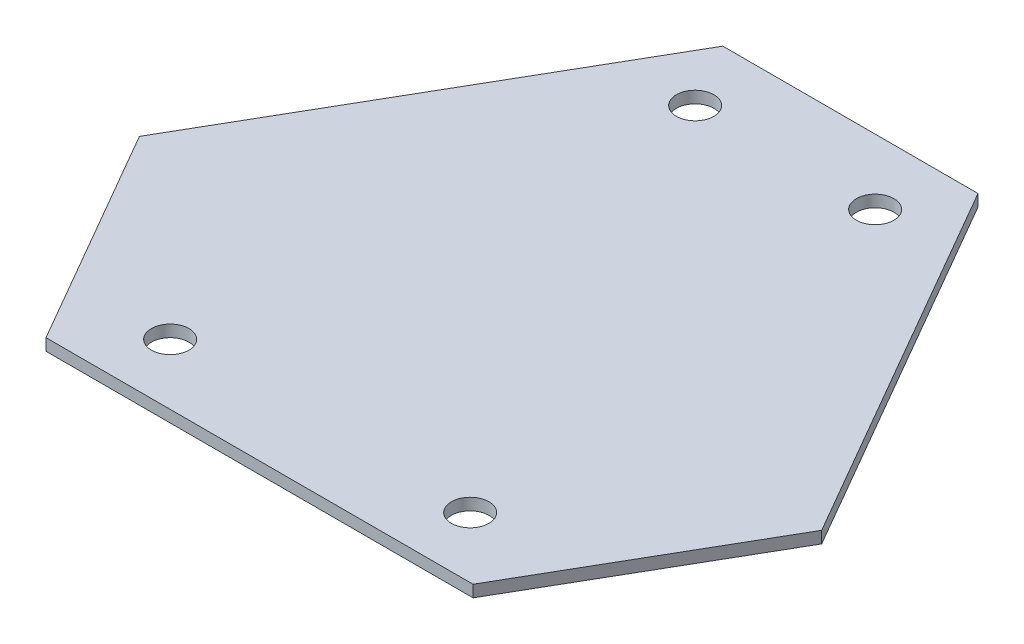
ISO-10303-21;
HEADER;
FILE_DESCRIPTION(('STEP AP214'),'2;1');
FILE_NAME('part.step','',(''),(''),'','','');
FILE_SCHEMA(('AUTOMOTIVE_DESIGN { 1 0 10303 214 1 1 1 1 }'));
ENDSEC;
DATA;
#1=APPLICATION_CONTEXT('core data for automotive mechanical design processes');
#2=APPLICATION_PROTOCOL_DEFINITION('international standard','automotive_design',2000,#1);
#3=PRODUCT_CONTEXT('',#1,'mechanical');
#4=PRODUCT('Part','Part','',(#3));
#5=PRODUCT_RELATED_PRODUCT_CATEGORY('part','',(#4));
#6=PRODUCT_DEFINITION_FORMATION('','',#4);
#7=PRODUCT_DEFINITION_CONTEXT('part definition',#1,'design');
#8=PRODUCT_DEFINITION('design','',#6,#7);
#9=PRODUCT_DEFINITION_SHAPE('','',#8);
#10=(LENGTH_UNIT() NAMED_UNIT(*) SI_UNIT(.MILLI.,.METRE.));
#11=(NAMED_UNIT(*) PLANE_ANGLE_UNIT() SI_UNIT($,.RADIAN.));
#12=(NAMED_UNIT(*) SI_UNIT($,.STERADIAN.) SOLID_ANGLE_UNIT());
#13=UNCERTAINTY_MEASURE_WITH_UNIT(LENGTH_MEASURE(1.E-05),#10,'distance_accuracy_value','');
#14=(GEOMETRIC_REPRESENTATION_CONTEXT(3) GLOBAL_UNCERTAINTY_ASSIGNED_CONTEXT((#13)) GLOBAL_UNIT_ASSIGNED_CONTEXT((#10,
#11,#12)) REPRESENTATION_CONTEXT('',''));
#15=CARTESIAN_POINT('',(0.,0.,0.));
#16=DIRECTION('',(0.,0.,1.));
#17=DIRECTION('',(1.,0.,0.));
#18=AXIS2_PLACEMENT_3D('',#15,#16,#17);
#19=CARTESIAN_POINT('',(0.,0.,0.));
#20=DIRECTION('',(0.,1.,0.));
#21=DIRECTION('',(0.,0.,1.));
#22=AXIS2_PLACEMENT_3D('',#19,#20,#21);
#23=PLANE('',#22);
#24=DIRECTION('',(0.500000000000002,0.,0.866025403784437));
#25=VECTOR('',#24,1.);
#26=CARTESIAN_POINT('',(15.875,0.,-9.16543552338539));
#27=LINE('',#26,#25);
#28=CARTESIAN_POINT('',(8.64301556751302,0.,-21.6916));
#29=VERTEX_POINT('',#28);
#30=CARTESIAN_POINT('',(23.1069844324869,0.,3.36072895322899));
#31=VERTEX_POINT('',#30);
#32=EDGE_CURVE('E162',#29,#31,#27,.T.);
#33=ORIENTED_EDGE('',*,*,#32,.T.);
#34=DIRECTION('',(-0.5,0.,0.866025403784439));
#35=VECTOR('',#34,1.);
#36=CARTESIAN_POINT('',(18.7854766487303,0.,10.8457999999999));
#37=LINE('',#36,#35);
#38=CARTESIAN_POINT('',(14.4639688649739,0.,18.3308710467703));
#39=VERTEX_POINT('',#38);
#40=EDGE_CURVE('E160',#31,#39,#37,.T.);
#41=ORIENTED_EDGE('',*,*,#40,.T.);
#42=DIRECTION('',(-1.,0.,0.));
#43=VECTOR('',#42,1.);
#44=CARTESIAN_POINT('',(0.,0.,18.3308710467703));
#45=LINE('',#44,#43);
#46=CARTESIAN_POINT('',(-14.4639688649738,0.,18.3308710467704));
#47=VERTEX_POINT('',#46);
#48=EDGE_CURVE('E98',#39,#47,#45,.T.);
#49=ORIENTED_EDGE('',*,*,#48,.T.);
#50=DIRECTION('',(-0.499999999999995,0.,-0.866025403784442));
#51=VECTOR('',#50,1.);
#52=CARTESIAN_POINT('',(-18.7854766487302,0.,10.8457999999997));
#53=LINE('',#52,#51);
#54=CARTESIAN_POINT('',(-23.1069844324867,0.,3.36072895322896));
#55=VERTEX_POINT('',#54);
#56=EDGE_CURVE('E168',#47,#55,#53,.T.);
#57=ORIENTED_EDGE('',*,*,#56,.T.);
#58=DIRECTION('',(0.499999999999998,0.,-0.86602540378444));
#59=VECTOR('',#58,1.);
#60=CARTESIAN_POINT('',(-15.875,0.,-9.16543552338526));
#61=LINE('',#60,#59);
#62=CARTESIAN_POINT('',(-8.64301556751303,0.,-21.6916));
#63=VERTEX_POINT('',#62);
#64=EDGE_CURVE('E124',#55,#63,#61,.T.);
#65=ORIENTED_EDGE('',*,*,#64,.T.);
#66=DIRECTION('',(1.,0.,0.));
#67=VECTOR('',#66,1.);
#68=CARTESIAN_POINT('',(0.,0.,-21.6916));
#69=LINE('',#68,#67);
#70=EDGE_CURVE('E164',#63,#29,#69,.T.);
#71=ORIENTED_EDGE('',*,*,#70,.T.);
#72=EDGE_LOOP('',(#33,#41,#49,#57,#65,#71));
#73=FACE_BOUND('',#72,.T.);
#74=CARTESIAN_POINT('',(6.096,0.,-17.272));
#75=DIRECTION('',(0.,1.,0.));
#76=DIRECTION('',(0.,0.,1.));
#77=AXIS2_PLACEMENT_3D('',#74,#75,#76);
#78=CIRCLE('',#77,1.27);
#79=CARTESIAN_POINT('',(6.096,0.,-16.002));
#80=VERTEX_POINT('',#79);
#81=EDGE_CURVE('E180',#80,#80,#78,.F.);
#82=ORIENTED_EDGE('',*,*,#81,.F.);
#83=EDGE_LOOP('',(#82));
#84=FACE_BOUND('',#83,.T.);
#85=CARTESIAN_POINT('',(-6.096,0.,-17.272));
#86=DIRECTION('',(0.,1.,0.));
#87=DIRECTION('',(0.,0.,1.));
#88=AXIS2_PLACEMENT_3D('',#85,#86,#87);
#89=CIRCLE('',#88,1.27);
#90=CARTESIAN_POINT('',(-6.096,0.,-16.002));
#91=VERTEX_POINT('',#90);
#92=EDGE_CURVE('E177',#91,#91,#89,.T.);
#93=ORIENTED_EDGE('',*,*,#92,.T.);
#94=EDGE_LOOP('',(#93));
#95=FACE_BOUND('',#94,.T.);
#96=CARTESIAN_POINT('',(-10.16,0.,14.224));
#97=DIRECTION('',(0.,1.,0.));
#98=DIRECTION('',(0.,0.,1.));
#99=AXIS2_PLACEMENT_3D('',#96,#97,#98);
#100=CIRCLE('',#99,1.27);
#101=CARTESIAN_POINT('',(-10.16,0.,15.494));
#102=VERTEX_POINT('',#101);
#103=EDGE_CURVE('E171',#102,#102,#100,.T.);
#104=ORIENTED_EDGE('',*,*,#103,.T.);
#105=EDGE_LOOP('',(#104));
#106=FACE_BOUND('',#105,.T.);
#107=CARTESIAN_POINT('',(10.16,0.,14.224));
#108=DIRECTION('',(0.,1.,0.));
#109=DIRECTION('',(0.,0.,1.));
#110=AXIS2_PLACEMENT_3D('',#107,#108,#109);
#111=CIRCLE('',#110,1.27);
#112=CARTESIAN_POINT('',(10.16,0.,15.494));
#113=VERTEX_POINT('',#112);
#114=EDGE_CURVE('E174',#113,#113,#111,.F.);
#115=ORIENTED_EDGE('',*,*,#114,.F.);
#116=EDGE_LOOP('',(#115));
#117=FACE_BOUND('',#116,.T.);
#118=ADVANCED_FACE('F59',(#73,#84,#95,#106,#117),#23,.F.);
#119=CARTESIAN_POINT('',(0.,0.8,0.));
#120=DIRECTION('',(0.,1.,0.));
#121=DIRECTION('',(0.,0.,1.));
#122=AXIS2_PLACEMENT_3D('',#119,#120,#121);
#123=PLANE('',#122);
#124=DIRECTION('',(-0.499999999999995,0.,-0.866025403784442));
#125=VECTOR('',#124,1.);
#126=CARTESIAN_POINT('',(-18.7854766487302,0.8,10.8457999999997));
#127=LINE('',#126,#125);
#128=CARTESIAN_POINT('',(-14.4639688649738,0.8,18.3308710467704));
#129=VERTEX_POINT('',#128);
#130=CARTESIAN_POINT('',(-23.1069844324867,0.8,3.36072895322896));
#131=VERTEX_POINT('',#130);
#132=EDGE_CURVE('E137',#129,#131,#127,.T.);
#133=ORIENTED_EDGE('',*,*,#132,.F.);
#134=DIRECTION('',(-1.,0.,0.));
#135=VECTOR('',#134,1.);
#136=CARTESIAN_POINT('',(0.,0.8,18.3308710467703));
#137=LINE('',#136,#135);
#138=CARTESIAN_POINT('',(14.4639688649739,0.8,18.3308710467703));
#139=VERTEX_POINT('',#138);
#140=EDGE_CURVE('E143',#139,#129,#137,.T.);
#141=ORIENTED_EDGE('',*,*,#140,.F.);
#142=DIRECTION('',(-0.5,0.,0.866025403784439));
#143=VECTOR('',#142,1.);
#144=CARTESIAN_POINT('',(18.7854766487303,0.8,10.8457999999999));
#145=LINE('',#144,#143);
#146=CARTESIAN_POINT('',(23.1069844324869,0.8,3.36072895322899));
#147=VERTEX_POINT('',#146);
#148=EDGE_CURVE('E183',#147,#139,#145,.T.);
#149=ORIENTED_EDGE('',*,*,#148,.F.);
#150=DIRECTION('',(0.500000000000002,0.,0.866025403784437));
#151=VECTOR('',#150,1.);
#152=CARTESIAN_POINT('',(15.875,0.8,-9.16543552338539));
#153=LINE('',#152,#151);
#154=CARTESIAN_POINT('',(8.64301556751302,0.8,-21.6916));
#155=VERTEX_POINT('',#154);
#156=EDGE_CURVE('E109',#155,#147,#153,.T.);
#157=ORIENTED_EDGE('',*,*,#156,.F.);
#158=DIRECTION('',(1.,0.,0.));
#159=VECTOR('',#158,1.);
#160=CARTESIAN_POINT('',(0.,0.8,-21.6916));
#161=LINE('',#160,#159);
#162=CARTESIAN_POINT('',(-8.64301556751303,0.8,-21.6916));
#163=VERTEX_POINT('',#162);
#164=EDGE_CURVE('E139',#163,#155,#161,.T.);
#165=ORIENTED_EDGE('',*,*,#164,.F.);
#166=DIRECTION('',(0.499999999999998,0.,-0.86602540378444));
#167=VECTOR('',#166,1.);
#168=CARTESIAN_POINT('',(-15.875,0.8,-9.16543552338526));
#169=LINE('',#168,#167);
#170=EDGE_CURVE('E122',#131,#163,#169,.T.);
#171=ORIENTED_EDGE('',*,*,#170,.F.);
#172=EDGE_LOOP('',(#133,#141,#149,#157,#165,#171));
#173=FACE_BOUND('',#172,.T.);
#174=CARTESIAN_POINT('',(6.096,0.8,-17.272));
#175=DIRECTION('',(0.,1.,0.));
#176=DIRECTION('',(0.,0.,1.));
#177=AXIS2_PLACEMENT_3D('',#174,#175,#176);
#178=CIRCLE('',#177,1.27);
#179=CARTESIAN_POINT('',(6.096,0.8,-16.002));
#180=VERTEX_POINT('',#179);
#181=EDGE_CURVE('E157',#180,#180,#178,.F.);
#182=ORIENTED_EDGE('',*,*,#181,.T.);
#183=EDGE_LOOP('',(#182));
#184=FACE_BOUND('',#183,.T.);
#185=CARTESIAN_POINT('',(-6.096,0.8,-17.272));
#186=DIRECTION('',(0.,1.,0.));
#187=DIRECTION('',(0.,0.,1.));
#188=AXIS2_PLACEMENT_3D('',#185,#186,#187);
#189=CIRCLE('',#188,1.27);
#190=CARTESIAN_POINT('',(-6.096,0.8,-16.002));
#191=VERTEX_POINT('',#190);
#192=EDGE_CURVE('E154',#191,#191,#189,.T.);
#193=ORIENTED_EDGE('',*,*,#192,.F.);
#194=EDGE_LOOP('',(#193));
#195=FACE_BOUND('',#194,.T.);
#196=CARTESIAN_POINT('',(-10.16,0.8,14.224));
#197=DIRECTION('',(0.,1.,0.));
#198=DIRECTION('',(0.,0.,1.));
#199=AXIS2_PLACEMENT_3D('',#196,#197,#198);
#200=CIRCLE('',#199,1.27);
#201=CARTESIAN_POINT('',(-10.16,0.8,15.494));
#202=VERTEX_POINT('',#201);
#203=EDGE_CURVE('E145',#202,#202,#200,.T.);
#204=ORIENTED_EDGE('',*,*,#203,.F.);
#205=EDGE_LOOP('',(#204));
#206=FACE_BOUND('',#205,.T.);
#207=CARTESIAN_POINT('',(10.16,0.8,14.224));
#208=DIRECTION('',(0.,1.,0.));
#209=DIRECTION('',(0.,0.,1.));
#210=AXIS2_PLACEMENT_3D('',#207,#208,#209);
#211=CIRCLE('',#210,1.27);
#212=CARTESIAN_POINT('',(10.16,0.8,15.494));
#213=VERTEX_POINT('',#212);
#214=EDGE_CURVE('E151',#213,#213,#211,.F.);
#215=ORIENTED_EDGE('',*,*,#214,.T.);
#216=EDGE_LOOP('',(#215));
#217=FACE_BOUND('',#216,.T.);
#218=ADVANCED_FACE('F134',(#173,#184,#195,#206,#217),#123,.T.);
#219=CARTESIAN_POINT('',(18.7854766487303,0.8,10.8457999999999));
#220=DIRECTION('',(0.866025403784439,0.,0.5));
#221=DIRECTION('',(0.5,0.,-0.866025403784439));
#222=AXIS2_PLACEMENT_3D('',#219,#220,#221);
#223=PLANE('',#222);
#224=ORIENTED_EDGE('',*,*,#40,.F.);
#225=DIRECTION('',(0.,-1.,0.));
#226=VECTOR('',#225,1.);
#227=CARTESIAN_POINT('',(23.1069844324869,0.8,3.36072895322899));
#228=LINE('',#227,#226);
#229=EDGE_CURVE('E12',#147,#31,#228,.T.);
#230=ORIENTED_EDGE('',*,*,#229,.F.);
#231=ORIENTED_EDGE('',*,*,#148,.T.);
#232=DIRECTION('',(0.,-1.,0.));
#233=VECTOR('',#232,1.);
#234=CARTESIAN_POINT('',(14.4639688649739,0.8,18.3308710467703));
#235=LINE('',#234,#233);
#236=EDGE_CURVE('E76',#139,#39,#235,.T.);
#237=ORIENTED_EDGE('',*,*,#236,.T.);
#238=EDGE_LOOP('',(#224,#230,#231,#237));
#239=FACE_BOUND('',#238,.T.);
#240=ADVANCED_FACE('F61',(#239),#223,.T.);
#241=CARTESIAN_POINT('',(10.16,0.8,14.224));
#242=DIRECTION('',(0.,-1.,0.));
#243=DIRECTION('',(0.,0.,-1.));
#244=AXIS2_PLACEMENT_3D('',#241,#242,#243);
#245=CYLINDRICAL_SURFACE('',#244,1.27);
#246=ORIENTED_EDGE('',*,*,#214,.F.);
#247=EDGE_LOOP('',(#246));
#248=FACE_BOUND('',#247,.T.);
#249=ORIENTED_EDGE('',*,*,#114,.T.);
#250=EDGE_LOOP('',(#249));
#251=FACE_BOUND('',#250,.T.);
#252=ADVANCED_FACE('F202',(#248,#251),#245,.F.);
#253=CARTESIAN_POINT('',(-18.7854766487302,0.8,10.8457999999997));
#254=DIRECTION('',(-0.866025403784441,0.,0.499999999999995));
#255=DIRECTION('',(0.499999999999995,0.,0.866025403784441));
#256=AXIS2_PLACEMENT_3D('',#253,#254,#255);
#257=PLANE('',#256);
#258=ORIENTED_EDGE('',*,*,#56,.F.);
#259=DIRECTION('',(0.,-1.,0.));
#260=VECTOR('',#259,1.);
#261=CARTESIAN_POINT('',(-14.4639688649738,0.8,18.3308710467704));
#262=LINE('',#261,#260);
#263=EDGE_CURVE('E129',#129,#47,#262,.T.);
#264=ORIENTED_EDGE('',*,*,#263,.F.);
#265=ORIENTED_EDGE('',*,*,#132,.T.);
#266=DIRECTION('',(0.,-1.,0.));
#267=VECTOR('',#266,1.);
#268=CARTESIAN_POINT('',(-23.1069844324867,0.8,3.36072895322896));
#269=LINE('',#268,#267);
#270=EDGE_CURVE('E118',#131,#55,#269,.T.);
#271=ORIENTED_EDGE('',*,*,#270,.T.);
#272=EDGE_LOOP('',(#258,#264,#265,#271));
#273=FACE_BOUND('',#272,.T.);
#274=ADVANCED_FACE('F142',(#273),#257,.T.);
#275=CARTESIAN_POINT('',(0.,0.8,18.3308710467703));
#276=DIRECTION('',(0.,0.,1.));
#277=DIRECTION('',(1.,0.,0.));
#278=AXIS2_PLACEMENT_3D('',#275,#276,#277);
#279=PLANE('',#278);
#280=ORIENTED_EDGE('',*,*,#263,.T.);
#281=ORIENTED_EDGE('',*,*,#48,.F.);
#282=ORIENTED_EDGE('',*,*,#236,.F.);
#283=ORIENTED_EDGE('',*,*,#140,.T.);
#284=EDGE_LOOP('',(#280,#281,#282,#283));
#285=FACE_BOUND('',#284,.T.);
#286=ADVANCED_FACE('F210',(#285),#279,.T.);
#287=CARTESIAN_POINT('',(-10.16,0.8,14.224));
#288=DIRECTION('',(0.,-1.,0.));
#289=DIRECTION('',(0.,0.,-1.));
#290=AXIS2_PLACEMENT_3D('',#287,#288,#289);
#291=CYLINDRICAL_SURFACE('',#290,1.27);
#292=ORIENTED_EDGE('',*,*,#203,.T.);
#293=EDGE_LOOP('',(#292));
#294=FACE_BOUND('',#293,.T.);
#295=ORIENTED_EDGE('',*,*,#103,.F.);
#296=EDGE_LOOP('',(#295));
#297=FACE_BOUND('',#296,.T.);
#298=ADVANCED_FACE('F217',(#294,#297),#291,.F.);
#299=CARTESIAN_POINT('',(15.875,0.8,-9.16543552338539));
#300=DIRECTION('',(0.866025403784437,0.,-0.500000000000002));
#301=DIRECTION('',(-0.500000000000002,0.,-0.866025403784437));
#302=AXIS2_PLACEMENT_3D('',#299,#300,#301);
#303=PLANE('',#302);
#304=ORIENTED_EDGE('',*,*,#156,.T.);
#305=ORIENTED_EDGE('',*,*,#229,.T.);
#306=ORIENTED_EDGE('',*,*,#32,.F.);
#307=DIRECTION('',(0.,-1.,0.));
#308=VECTOR('',#307,1.);
#309=CARTESIAN_POINT('',(8.64301556751302,0.8,-21.6916));
#310=LINE('',#309,#308);
#311=EDGE_CURVE('E68',#155,#29,#310,.T.);
#312=ORIENTED_EDGE('',*,*,#311,.F.);
#313=EDGE_LOOP('',(#304,#305,#306,#312));
#314=FACE_BOUND('',#313,.T.);
#315=ADVANCED_FACE('F190',(#314),#303,.T.);
#316=CARTESIAN_POINT('',(0.,0.8,-21.6916));
#317=DIRECTION('',(0.,0.,-1.));
#318=DIRECTION('',(-1.,0.,0.));
#319=AXIS2_PLACEMENT_3D('',#316,#317,#318);
#320=PLANE('',#319);
#321=ORIENTED_EDGE('',*,*,#70,.F.);
#322=DIRECTION('',(0.,-1.,0.));
#323=VECTOR('',#322,1.);
#324=CARTESIAN_POINT('',(-8.64301556751303,0.8,-21.6916));
#325=LINE('',#324,#323);
#326=EDGE_CURVE('E128',#163,#63,#325,.T.);
#327=ORIENTED_EDGE('',*,*,#326,.F.);
#328=ORIENTED_EDGE('',*,*,#164,.T.);
#329=ORIENTED_EDGE('',*,*,#311,.T.);
#330=EDGE_LOOP('',(#321,#327,#328,#329));
#331=FACE_BOUND('',#330,.T.);
#332=ADVANCED_FACE('F189',(#331),#320,.T.);
#333=CARTESIAN_POINT('',(-15.875,0.8,-9.16543552338526));
#334=DIRECTION('',(-0.86602540378444,0.,-0.499999999999998));
#335=DIRECTION('',(-0.499999999999998,0.,0.86602540378444));
#336=AXIS2_PLACEMENT_3D('',#333,#334,#335);
#337=PLANE('',#336);
#338=ORIENTED_EDGE('',*,*,#326,.T.);
#339=ORIENTED_EDGE('',*,*,#64,.F.);
#340=ORIENTED_EDGE('',*,*,#270,.F.);
#341=ORIENTED_EDGE('',*,*,#170,.T.);
#342=EDGE_LOOP('',(#338,#339,#340,#341));
#343=FACE_BOUND('',#342,.T.);
#344=ADVANCED_FACE('F121',(#343),#337,.T.);
#345=CARTESIAN_POINT('',(-6.096,0.8,-17.272));
#346=DIRECTION('',(0.,-1.,0.));
#347=DIRECTION('',(0.,0.,-1.));
#348=AXIS2_PLACEMENT_3D('',#345,#346,#347);
#349=CYLINDRICAL_SURFACE('',#348,1.27);
#350=ORIENTED_EDGE('',*,*,#192,.T.);
#351=EDGE_LOOP('',(#350));
#352=FACE_BOUND('',#351,.T.);
#353=ORIENTED_EDGE('',*,*,#92,.F.);
#354=EDGE_LOOP('',(#353));
#355=FACE_BOUND('',#354,.T.);
#356=ADVANCED_FACE('F215',(#352,#355),#349,.F.);
#357=CARTESIAN_POINT('',(6.096,0.8,-17.272));
#358=DIRECTION('',(0.,-1.,0.));
#359=DIRECTION('',(0.,0.,-1.));
#360=AXIS2_PLACEMENT_3D('',#357,#358,#359);
#361=CYLINDRICAL_SURFACE('',#360,1.27);
#362=ORIENTED_EDGE('',*,*,#181,.F.);
#363=EDGE_LOOP('',(#362));
#364=FACE_BOUND('',#363,.T.);
#365=ORIENTED_EDGE('',*,*,#81,.T.);
#366=EDGE_LOOP('',(#365));
#367=FACE_BOUND('',#366,.T.);
#368=ADVANCED_FACE('F245',(#364,#367),#361,.F.);
#369=CLOSED_SHELL('',(#118,#218,#240,#252,#274,#286,#298,#315,#332,#344,#356,#368));
#370=MANIFOLD_SOLID_BREP('B2',#369);
#371=ADVANCED_BREP_SHAPE_REPRESENTATION('',(#18,#370),#14);
#372=SHAPE_DEFINITION_REPRESENTATION(#9,#371);
ENDSEC;
END-ISO-10303-21;
